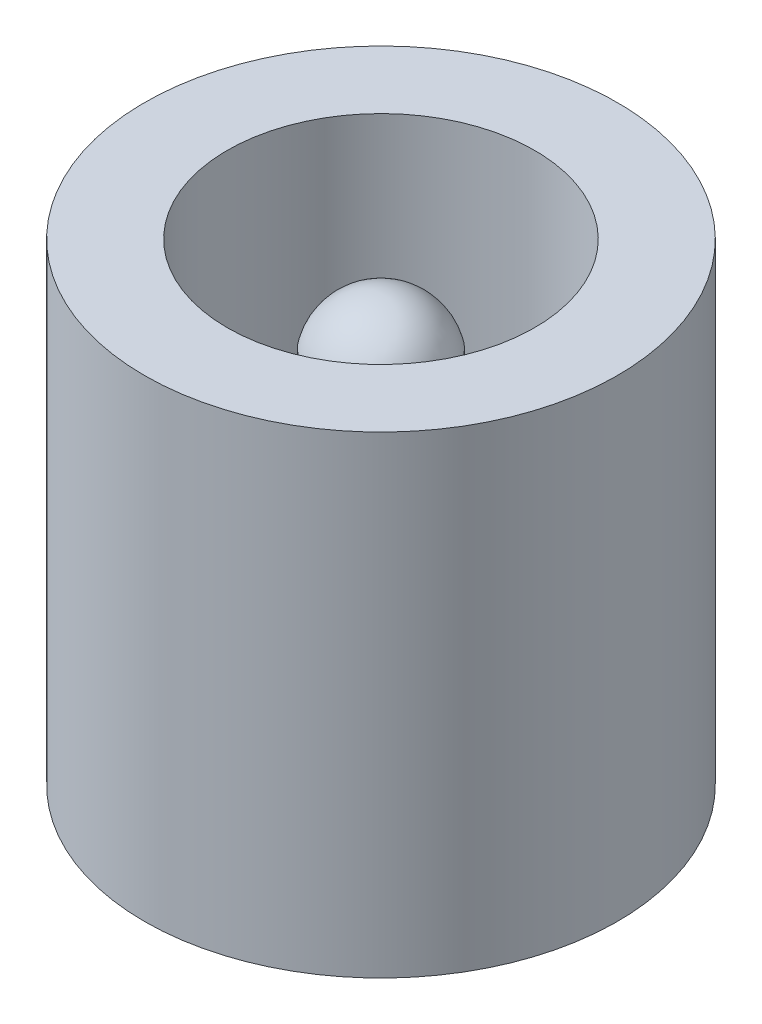
ISO-10303-21;
HEADER;
FILE_DESCRIPTION(('STEP AP214'),'2;1');
FILE_NAME('part.step','',(''),(''),'','','');
FILE_SCHEMA(('AUTOMOTIVE_DESIGN { 1 0 10303 214 1 1 1 1 }'));
ENDSEC;
DATA;
#1=APPLICATION_CONTEXT('core data for automotive mechanical design processes');
#2=APPLICATION_PROTOCOL_DEFINITION('international standard','automotive_design',2000,#1);
#3=PRODUCT_CONTEXT('',#1,'mechanical');
#4=PRODUCT('Part','Part','',(#3));
#5=PRODUCT_RELATED_PRODUCT_CATEGORY('part','',(#4));
#6=PRODUCT_DEFINITION_FORMATION('','',#4);
#7=PRODUCT_DEFINITION_CONTEXT('part definition',#1,'design');
#8=PRODUCT_DEFINITION('design','',#6,#7);
#9=PRODUCT_DEFINITION_SHAPE('','',#8);
#10=(LENGTH_UNIT() NAMED_UNIT(*) SI_UNIT(.MILLI.,.METRE.));
#11=(NAMED_UNIT(*) PLANE_ANGLE_UNIT() SI_UNIT($,.RADIAN.));
#12=(NAMED_UNIT(*) SI_UNIT($,.STERADIAN.) SOLID_ANGLE_UNIT());
#13=UNCERTAINTY_MEASURE_WITH_UNIT(LENGTH_MEASURE(1.E-05),#10,'distance_accuracy_value','');
#14=(GEOMETRIC_REPRESENTATION_CONTEXT(3) GLOBAL_UNCERTAINTY_ASSIGNED_CONTEXT((#13)) GLOBAL_UNIT_ASSIGNED_CONTEXT((#10,
#11,#12)) REPRESENTATION_CONTEXT('',''));
#15=CARTESIAN_POINT('',(0.,0.,0.));
#16=DIRECTION('',(0.,0.,1.));
#17=DIRECTION('',(1.,0.,0.));
#18=AXIS2_PLACEMENT_3D('',#15,#16,#17);
#19=CARTESIAN_POINT('',(0.,2.,0.));
#20=DIRECTION('',(0.,1.,0.));
#21=DIRECTION('',(0.,0.,1.));
#22=AXIS2_PLACEMENT_3D('',#19,#20,#21);
#23=PLANE('',#22);
#24=CARTESIAN_POINT('',(0.,2.,0.));
#25=DIRECTION('',(0.,1.,0.));
#26=DIRECTION('',(0.,0.,1.));
#27=AXIS2_PLACEMENT_3D('',#24,#25,#26);
#28=CIRCLE('',#27,3.25);
#29=CARTESIAN_POINT('',(0.,2.,3.25));
#30=VERTEX_POINT('',#29);
#31=EDGE_CURVE('E46',#30,#30,#28,.T.);
#32=ORIENTED_EDGE('',*,*,#31,.T.);
#33=EDGE_LOOP('',(#32));
#34=FACE_BOUND('',#33,.T.);
#35=CARTESIAN_POINT('',(0.,2.,0.));
#36=DIRECTION('',(0.,1.,0.));
#37=DIRECTION('',(0.,0.,1.));
#38=AXIS2_PLACEMENT_3D('',#35,#36,#37);
#39=CIRCLE('',#38,1.25);
#40=CARTESIAN_POINT('',(0.,2.,1.25));
#41=VERTEX_POINT('',#40);
#42=EDGE_CURVE('E53',#41,#41,#39,.T.);
#43=ORIENTED_EDGE('',*,*,#42,.F.);
#44=EDGE_LOOP('',(#43));
#45=FACE_BOUND('',#44,.T.);
#46=ADVANCED_FACE('F33',(#34,#45),#23,.T.);
#47=CARTESIAN_POINT('',(0.,10.,0.));
#48=DIRECTION('',(0.,-1.,0.));
#49=DIRECTION('',(0.,0.,-1.));
#50=AXIS2_PLACEMENT_3D('',#47,#48,#49);
#51=CYLINDRICAL_SURFACE('',#50,5.);
#52=CARTESIAN_POINT('',(0.,10.,0.));
#53=DIRECTION('',(0.,1.,0.));
#54=DIRECTION('',(0.,0.,1.));
#55=AXIS2_PLACEMENT_3D('',#52,#53,#54);
#56=CIRCLE('',#55,5.);
#57=CARTESIAN_POINT('',(0.,10.,5.));
#58=VERTEX_POINT('',#57);
#59=EDGE_CURVE('E10',#58,#58,#56,.T.);
#60=ORIENTED_EDGE('',*,*,#59,.F.);
#61=EDGE_LOOP('',(#60));
#62=FACE_BOUND('',#61,.T.);
#63=CARTESIAN_POINT('',(0.,0.,0.));
#64=DIRECTION('',(0.,1.,0.));
#65=DIRECTION('',(0.,0.,1.));
#66=AXIS2_PLACEMENT_3D('',#63,#64,#65);
#67=CIRCLE('',#66,5.);
#68=CARTESIAN_POINT('',(0.,0.,5.));
#69=VERTEX_POINT('',#68);
#70=EDGE_CURVE('E41',#69,#69,#67,.T.);
#71=ORIENTED_EDGE('',*,*,#70,.T.);
#72=EDGE_LOOP('',(#71));
#73=FACE_BOUND('',#72,.T.);
#74=ADVANCED_FACE('F74',(#62,#73),#51,.T.);
#75=CARTESIAN_POINT('',(0.,10.,0.));
#76=DIRECTION('',(0.,1.,0.));
#77=DIRECTION('',(0.,0.,1.));
#78=AXIS2_PLACEMENT_3D('',#75,#76,#77);
#79=PLANE('',#78);
#80=CARTESIAN_POINT('',(0.,10.,0.));
#81=DIRECTION('',(0.,1.,0.));
#82=DIRECTION('',(0.,0.,1.));
#83=AXIS2_PLACEMENT_3D('',#80,#81,#82);
#84=CIRCLE('',#83,3.25);
#85=CARTESIAN_POINT('',(0.,10.,3.25));
#86=VERTEX_POINT('',#85);
#87=EDGE_CURVE('E48',#86,#86,#84,.T.);
#88=ORIENTED_EDGE('',*,*,#87,.F.);
#89=EDGE_LOOP('',(#88));
#90=FACE_BOUND('',#89,.T.);
#91=ORIENTED_EDGE('',*,*,#59,.T.);
#92=EDGE_LOOP('',(#91));
#93=FACE_BOUND('',#92,.T.);
#94=ADVANCED_FACE('F79',(#90,#93),#79,.T.);
#95=CARTESIAN_POINT('',(0.,0.,0.));
#96=DIRECTION('',(0.,1.,0.));
#97=DIRECTION('',(0.,0.,1.));
#98=AXIS2_PLACEMENT_3D('',#95,#96,#97);
#99=PLANE('',#98);
#100=ORIENTED_EDGE('',*,*,#70,.F.);
#101=EDGE_LOOP('',(#100));
#102=FACE_BOUND('',#101,.T.);
#103=ADVANCED_FACE('F69',(#102),#99,.F.);
#104=CARTESIAN_POINT('',(0.,2.,0.));
#105=DIRECTION('',(0.,1.,0.));
#106=DIRECTION('',(0.,0.,1.));
#107=AXIS2_PLACEMENT_3D('',#104,#105,#106);
#108=CYLINDRICAL_SURFACE('',#107,3.25);
#109=ORIENTED_EDGE('',*,*,#31,.F.);
#110=EDGE_LOOP('',(#109));
#111=FACE_BOUND('',#110,.T.);
#112=ORIENTED_EDGE('',*,*,#87,.T.);
#113=EDGE_LOOP('',(#112));
#114=FACE_BOUND('',#113,.T.);
#115=ADVANCED_FACE('F63',(#111,#114),#108,.F.);
#116=CARTESIAN_POINT('',(0.,8.,0.));
#117=DIRECTION('',(0.,-1.,0.));
#118=DIRECTION('',(0.,0.,-1.));
#119=AXIS2_PLACEMENT_3D('',#116,#117,#118);
#120=CYLINDRICAL_SURFACE('',#119,1.25);
#121=CARTESIAN_POINT('',(0.,8.,0.));
#122=DIRECTION('',(0.,1.,0.));
#123=DIRECTION('',(0.,0.,1.));
#124=AXIS2_PLACEMENT_3D('',#121,#122,#123);
#125=CIRCLE('',#124,1.25);
#126=CARTESIAN_POINT('',(0.,8.,1.25));
#127=VERTEX_POINT('',#126);
#128=EDGE_CURVE('E37',#127,#127,#125,.T.);
#129=ORIENTED_EDGE('',*,*,#128,.F.);
#130=EDGE_LOOP('',(#129));
#131=FACE_BOUND('',#130,.T.);
#132=ORIENTED_EDGE('',*,*,#42,.T.);
#133=EDGE_LOOP('',(#132));
#134=FACE_BOUND('',#133,.T.);
#135=ADVANCED_FACE('F61',(#131,#134),#120,.T.);
#136=CARTESIAN_POINT('',(0.,7.71875,0.));
#137=DIRECTION('',(0.,0.,1.));
#138=DIRECTION('',(1.,0.,0.));
#139=AXIS2_PLACEMENT_3D('',#136,#137,#138);
#140=SPHERICAL_SURFACE('',#139,1.28125);
#141=CARTESIAN_POINT('',(0.,7.71875,0.));
#142=DIRECTION('',(0.,1.,0.));
#143=DIRECTION('',(0.,0.,1.));
#144=AXIS2_PLACEMENT_3D('',#141,#142,#143);
#145=SPHERICAL_SURFACE('',#144,1.28125);
#146=ORIENTED_EDGE('',*,*,#128,.T.);
#147=EDGE_LOOP('',(#146));
#148=FACE_BOUND('',#147,.T.);
#149=ADVANCED_FACE('F35',(#148),#145,.T.);
#150=CLOSED_SHELL('',(#46,#74,#94,#103,#115,#135,#149));
#151=MANIFOLD_SOLID_BREP('B2',#150);
#152=ADVANCED_BREP_SHAPE_REPRESENTATION('',(#18,#151),#14);
#153=SHAPE_DEFINITION_REPRESENTATION(#9,#152);
ENDSEC;
END-ISO-10303-21;
